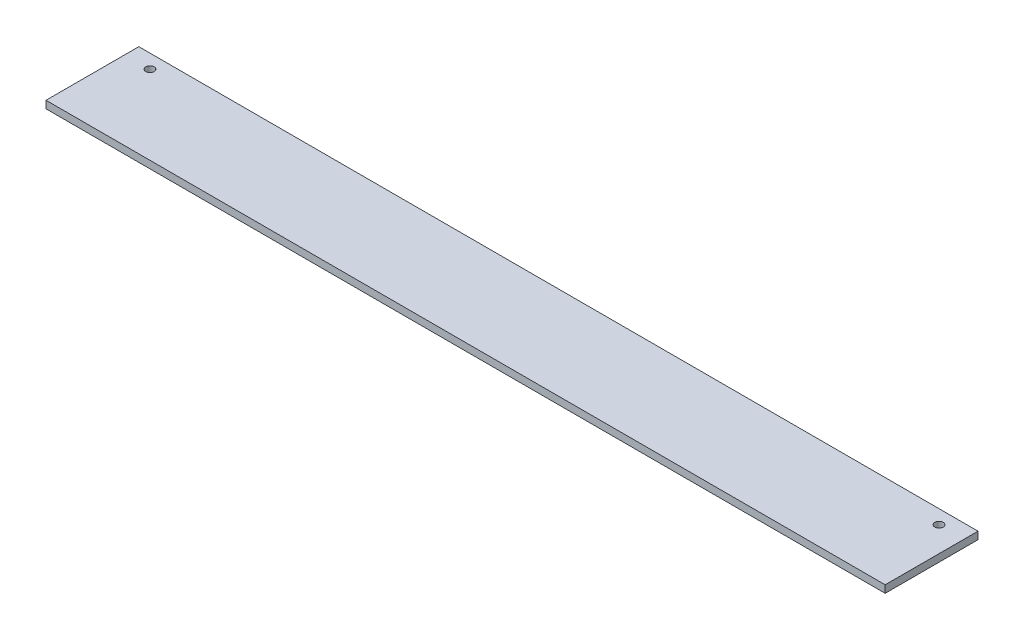
ISO-10303-21;
HEADER;
FILE_DESCRIPTION(('STEP AP214'),'2;1');
FILE_NAME('part.step','',(''),(''),'','','');
FILE_SCHEMA(('AUTOMOTIVE_DESIGN { 1 0 10303 214 1 1 1 1 }'));
ENDSEC;
DATA;
#1=APPLICATION_CONTEXT('core data for automotive mechanical design processes');
#2=APPLICATION_PROTOCOL_DEFINITION('international standard','automotive_design',2000,#1);
#3=PRODUCT_CONTEXT('',#1,'mechanical');
#4=PRODUCT('Part','Part','',(#3));
#5=PRODUCT_RELATED_PRODUCT_CATEGORY('part','',(#4));
#6=PRODUCT_DEFINITION_FORMATION('','',#4);
#7=PRODUCT_DEFINITION_CONTEXT('part definition',#1,'design');
#8=PRODUCT_DEFINITION('design','',#6,#7);
#9=PRODUCT_DEFINITION_SHAPE('','',#8);
#10=(LENGTH_UNIT() NAMED_UNIT(*) SI_UNIT(.MILLI.,.METRE.));
#11=(NAMED_UNIT(*) PLANE_ANGLE_UNIT() SI_UNIT($,.RADIAN.));
#12=(NAMED_UNIT(*) SI_UNIT($,.STERADIAN.) SOLID_ANGLE_UNIT());
#13=UNCERTAINTY_MEASURE_WITH_UNIT(LENGTH_MEASURE(1.E-05),#10,'distance_accuracy_value','');
#14=(GEOMETRIC_REPRESENTATION_CONTEXT(3) GLOBAL_UNCERTAINTY_ASSIGNED_CONTEXT((#13)) GLOBAL_UNIT_ASSIGNED_CONTEXT((#10,
#11,#12)) REPRESENTATION_CONTEXT('',''));
#15=CARTESIAN_POINT('',(0.,0.,0.));
#16=DIRECTION('',(0.,0.,1.));
#17=DIRECTION('',(1.,0.,0.));
#18=AXIS2_PLACEMENT_3D('',#15,#16,#17);
#19=CARTESIAN_POINT('',(452.,-2.,-25.));
#20=DIRECTION('',(0.,0.,1.));
#21=DIRECTION('',(1.,0.,0.));
#22=AXIS2_PLACEMENT_3D('',#19,#20,#21);
#23=PLANE('',#22);
#24=DIRECTION('',(0.,1.,0.));
#25=VECTOR('',#24,1.);
#26=CARTESIAN_POINT('',(0.,-2.,-25.));
#27=LINE('',#26,#25);
#28=CARTESIAN_POINT('',(0.,-2.,-25.));
#29=VERTEX_POINT('',#28);
#30=CARTESIAN_POINT('',(0.,2.,-25.));
#31=VERTEX_POINT('',#30);
#32=EDGE_CURVE('E98',#29,#31,#27,.T.);
#33=ORIENTED_EDGE('',*,*,#32,.T.);
#34=DIRECTION('',(-1.,0.,0.));
#35=VECTOR('',#34,1.);
#36=CARTESIAN_POINT('',(452.,2.,-25.));
#37=LINE('',#36,#35);
#38=CARTESIAN_POINT('',(452.,2.,-25.));
#39=VERTEX_POINT('',#38);
#40=EDGE_CURVE('E11',#39,#31,#37,.T.);
#41=ORIENTED_EDGE('',*,*,#40,.F.);
#42=DIRECTION('',(0.,1.,0.));
#43=VECTOR('',#42,1.);
#44=CARTESIAN_POINT('',(452.,-2.,-25.));
#45=LINE('',#44,#43);
#46=CARTESIAN_POINT('',(452.,-2.,-25.));
#47=VERTEX_POINT('',#46);
#48=EDGE_CURVE('E86',#47,#39,#45,.T.);
#49=ORIENTED_EDGE('',*,*,#48,.F.);
#50=DIRECTION('',(-1.,0.,0.));
#51=VECTOR('',#50,1.);
#52=CARTESIAN_POINT('',(452.,-2.,-25.));
#53=LINE('',#52,#51);
#54=EDGE_CURVE('E94',#47,#29,#53,.T.);
#55=ORIENTED_EDGE('',*,*,#54,.T.);
#56=EDGE_LOOP('',(#33,#41,#49,#55));
#57=FACE_BOUND('',#56,.T.);
#58=ADVANCED_FACE('F35',(#57),#23,.F.);
#59=CARTESIAN_POINT('',(452.,2.,25.));
#60=DIRECTION('',(0.,-1.,0.));
#61=DIRECTION('',(0.,0.,-1.));
#62=AXIS2_PLACEMENT_3D('',#59,#60,#61);
#63=PLANE('',#62);
#64=CARTESIAN_POINT('',(13.5,2.,-17.5));
#65=DIRECTION('',(0.,1.,0.));
#66=DIRECTION('',(0.,0.,1.));
#67=AXIS2_PLACEMENT_3D('',#64,#65,#66);
#68=CIRCLE('',#67,2.25);
#69=CARTESIAN_POINT('',(13.5,2.,-15.25));
#70=VERTEX_POINT('',#69);
#71=EDGE_CURVE('E118',#70,#70,#68,.T.);
#72=ORIENTED_EDGE('',*,*,#71,.F.);
#73=EDGE_LOOP('',(#72));
#74=FACE_BOUND('',#73,.T.);
#75=CARTESIAN_POINT('',(438.5,2.,-17.5));
#76=DIRECTION('',(0.,1.,0.));
#77=DIRECTION('',(0.,0.,1.));
#78=AXIS2_PLACEMENT_3D('',#75,#76,#77);
#79=CIRCLE('',#78,2.24999999999995);
#80=CARTESIAN_POINT('',(438.5,2.,-15.2500000000001));
#81=VERTEX_POINT('',#80);
#82=EDGE_CURVE('E112',#81,#81,#79,.T.);
#83=ORIENTED_EDGE('',*,*,#82,.F.);
#84=EDGE_LOOP('',(#83));
#85=FACE_BOUND('',#84,.T.);
#86=DIRECTION('',(0.,0.,1.));
#87=VECTOR('',#86,1.);
#88=CARTESIAN_POINT('',(0.,2.,25.));
#89=LINE('',#88,#87);
#90=CARTESIAN_POINT('',(0.,2.,25.));
#91=VERTEX_POINT('',#90);
#92=EDGE_CURVE('E90',#31,#91,#89,.T.);
#93=ORIENTED_EDGE('',*,*,#92,.T.);
#94=DIRECTION('',(-1.,0.,0.));
#95=VECTOR('',#94,1.);
#96=CARTESIAN_POINT('',(452.,2.,25.));
#97=LINE('',#96,#95);
#98=CARTESIAN_POINT('',(452.,2.,25.));
#99=VERTEX_POINT('',#98);
#100=EDGE_CURVE('E43',#99,#91,#97,.T.);
#101=ORIENTED_EDGE('',*,*,#100,.F.);
#102=DIRECTION('',(0.,0.,1.));
#103=VECTOR('',#102,1.);
#104=CARTESIAN_POINT('',(452.,2.,25.));
#105=LINE('',#104,#103);
#106=EDGE_CURVE('E81',#39,#99,#105,.T.);
#107=ORIENTED_EDGE('',*,*,#106,.F.);
#108=ORIENTED_EDGE('',*,*,#40,.T.);
#109=EDGE_LOOP('',(#93,#101,#107,#108));
#110=FACE_BOUND('',#109,.T.);
#111=ADVANCED_FACE('F89',(#74,#85,#110),#63,.F.);
#112=CARTESIAN_POINT('',(452.,-2.,25.));
#113=DIRECTION('',(0.,0.,-1.));
#114=DIRECTION('',(-1.,0.,0.));
#115=AXIS2_PLACEMENT_3D('',#112,#113,#114);
#116=PLANE('',#115);
#117=DIRECTION('',(0.,-1.,0.));
#118=VECTOR('',#117,1.);
#119=CARTESIAN_POINT('',(0.,-2.,25.));
#120=LINE('',#119,#118);
#121=CARTESIAN_POINT('',(0.,-2.,25.));
#122=VERTEX_POINT('',#121);
#123=EDGE_CURVE('E68',#91,#122,#120,.T.);
#124=ORIENTED_EDGE('',*,*,#123,.T.);
#125=DIRECTION('',(-1.,0.,0.));
#126=VECTOR('',#125,1.);
#127=CARTESIAN_POINT('',(452.,-2.,25.));
#128=LINE('',#127,#126);
#129=CARTESIAN_POINT('',(452.,-2.,25.));
#130=VERTEX_POINT('',#129);
#131=EDGE_CURVE('E91',#130,#122,#128,.T.);
#132=ORIENTED_EDGE('',*,*,#131,.F.);
#133=DIRECTION('',(0.,-1.,0.));
#134=VECTOR('',#133,1.);
#135=CARTESIAN_POINT('',(452.,-2.,25.));
#136=LINE('',#135,#134);
#137=EDGE_CURVE('E84',#99,#130,#136,.T.);
#138=ORIENTED_EDGE('',*,*,#137,.F.);
#139=ORIENTED_EDGE('',*,*,#100,.T.);
#140=EDGE_LOOP('',(#124,#132,#138,#139));
#141=FACE_BOUND('',#140,.T.);
#142=ADVANCED_FACE('F92',(#141),#116,.F.);
#143=CARTESIAN_POINT('',(452.,-2.,25.));
#144=DIRECTION('',(0.,1.,0.));
#145=DIRECTION('',(0.,0.,1.));
#146=AXIS2_PLACEMENT_3D('',#143,#144,#145);
#147=PLANE('',#146);
#148=CARTESIAN_POINT('',(13.5,-2.,-17.5));
#149=DIRECTION('',(0.,1.,0.));
#150=DIRECTION('',(0.,0.,1.));
#151=AXIS2_PLACEMENT_3D('',#148,#149,#150);
#152=CIRCLE('',#151,2.25);
#153=CARTESIAN_POINT('',(13.5,-2.,-15.25));
#154=VERTEX_POINT('',#153);
#155=EDGE_CURVE('E101',#154,#154,#152,.T.);
#156=ORIENTED_EDGE('',*,*,#155,.T.);
#157=EDGE_LOOP('',(#156));
#158=FACE_BOUND('',#157,.T.);
#159=CARTESIAN_POINT('',(438.5,-2.,-17.5));
#160=DIRECTION('',(0.,1.,0.));
#161=DIRECTION('',(0.,0.,1.));
#162=AXIS2_PLACEMENT_3D('',#159,#160,#161);
#163=CIRCLE('',#162,2.24999999999995);
#164=CARTESIAN_POINT('',(438.5,-2.,-15.2500000000001));
#165=VERTEX_POINT('',#164);
#166=EDGE_CURVE('E115',#165,#165,#163,.T.);
#167=ORIENTED_EDGE('',*,*,#166,.T.);
#168=EDGE_LOOP('',(#167));
#169=FACE_BOUND('',#168,.T.);
#170=DIRECTION('',(0.,0.,-1.));
#171=VECTOR('',#170,1.);
#172=CARTESIAN_POINT('',(0.,-2.,25.));
#173=LINE('',#172,#171);
#174=EDGE_CURVE('E74',#122,#29,#173,.T.);
#175=ORIENTED_EDGE('',*,*,#174,.T.);
#176=ORIENTED_EDGE('',*,*,#54,.F.);
#177=DIRECTION('',(0.,0.,-1.));
#178=VECTOR('',#177,1.);
#179=CARTESIAN_POINT('',(452.,-2.,25.));
#180=LINE('',#179,#178);
#181=EDGE_CURVE('E51',#130,#47,#180,.T.);
#182=ORIENTED_EDGE('',*,*,#181,.F.);
#183=ORIENTED_EDGE('',*,*,#131,.T.);
#184=EDGE_LOOP('',(#175,#176,#182,#183));
#185=FACE_BOUND('',#184,.T.);
#186=ADVANCED_FACE('F106',(#158,#169,#185),#147,.F.);
#187=CARTESIAN_POINT('',(452.,0.,0.));
#188=DIRECTION('',(-1.,0.,0.));
#189=DIRECTION('',(0.,0.,1.));
#190=AXIS2_PLACEMENT_3D('',#187,#188,#189);
#191=PLANE('',#190);
#192=ORIENTED_EDGE('',*,*,#48,.T.);
#193=ORIENTED_EDGE('',*,*,#106,.T.);
#194=ORIENTED_EDGE('',*,*,#137,.T.);
#195=ORIENTED_EDGE('',*,*,#181,.T.);
#196=EDGE_LOOP('',(#192,#193,#194,#195));
#197=FACE_BOUND('',#196,.T.);
#198=ADVANCED_FACE('F82',(#197),#191,.F.);
#199=CARTESIAN_POINT('',(0.,0.,0.));
#200=DIRECTION('',(-1.,0.,0.));
#201=DIRECTION('',(0.,0.,1.));
#202=AXIS2_PLACEMENT_3D('',#199,#200,#201);
#203=PLANE('',#202);
#204=ORIENTED_EDGE('',*,*,#32,.F.);
#205=ORIENTED_EDGE('',*,*,#174,.F.);
#206=ORIENTED_EDGE('',*,*,#123,.F.);
#207=ORIENTED_EDGE('',*,*,#92,.F.);
#208=EDGE_LOOP('',(#204,#205,#206,#207));
#209=FACE_BOUND('',#208,.T.);
#210=ADVANCED_FACE('F109',(#209),#203,.T.);
#211=CARTESIAN_POINT('',(438.5,-2.,-17.5));
#212=DIRECTION('',(0.,1.,0.));
#213=DIRECTION('',(0.,0.,1.));
#214=AXIS2_PLACEMENT_3D('',#211,#212,#213);
#215=CYLINDRICAL_SURFACE('',#214,2.24999999999995);
#216=ORIENTED_EDGE('',*,*,#166,.F.);
#217=EDGE_LOOP('',(#216));
#218=FACE_BOUND('',#217,.T.);
#219=ORIENTED_EDGE('',*,*,#82,.T.);
#220=EDGE_LOOP('',(#219));
#221=FACE_BOUND('',#220,.T.);
#222=ADVANCED_FACE('F129',(#218,#221),#215,.F.);
#223=CARTESIAN_POINT('',(13.5,-2.,-17.5));
#224=DIRECTION('',(0.,1.,0.));
#225=DIRECTION('',(0.,0.,1.));
#226=AXIS2_PLACEMENT_3D('',#223,#224,#225);
#227=CYLINDRICAL_SURFACE('',#226,2.25);
#228=ORIENTED_EDGE('',*,*,#155,.F.);
#229=EDGE_LOOP('',(#228));
#230=FACE_BOUND('',#229,.T.);
#231=ORIENTED_EDGE('',*,*,#71,.T.);
#232=EDGE_LOOP('',(#231));
#233=FACE_BOUND('',#232,.T.);
#234=ADVANCED_FACE('F126',(#230,#233),#227,.F.);
#235=CLOSED_SHELL('',(#58,#111,#142,#186,#198,#210,#222,#234));
#236=MANIFOLD_SOLID_BREP('B2',#235);
#237=ADVANCED_BREP_SHAPE_REPRESENTATION('',(#18,#236),#14);
#238=SHAPE_DEFINITION_REPRESENTATION(#9,#237);
ENDSEC;
END-ISO-10303-21;
